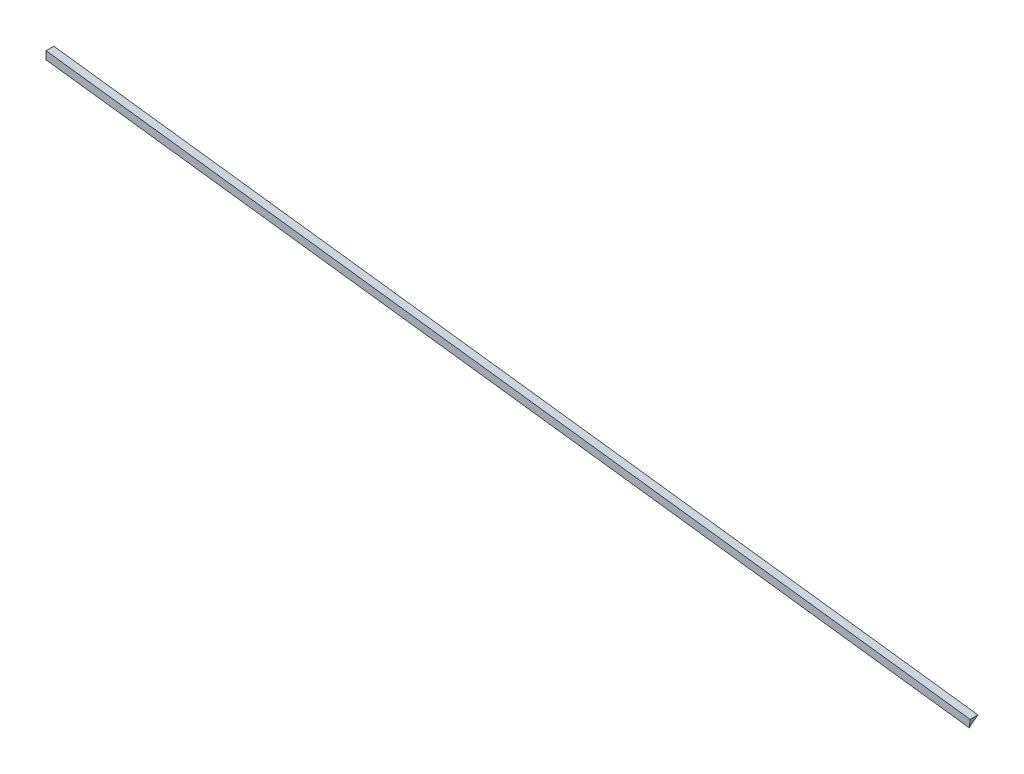
ISO-10303-21;
HEADER;
FILE_DESCRIPTION(('STEP AP214'),'2;1');
FILE_NAME('part.step','',(''),(''),'','','');
FILE_SCHEMA(('AUTOMOTIVE_DESIGN { 1 0 10303 214 1 1 1 1 }'));
ENDSEC;
DATA;
#1=APPLICATION_CONTEXT('core data for automotive mechanical design processes');
#2=APPLICATION_PROTOCOL_DEFINITION('international standard','automotive_design',2000,#1);
#3=PRODUCT_CONTEXT('',#1,'mechanical');
#4=PRODUCT('Part','Part','',(#3));
#5=PRODUCT_RELATED_PRODUCT_CATEGORY('part','',(#4));
#6=PRODUCT_DEFINITION_FORMATION('','',#4);
#7=PRODUCT_DEFINITION_CONTEXT('part definition',#1,'design');
#8=PRODUCT_DEFINITION('design','',#6,#7);
#9=PRODUCT_DEFINITION_SHAPE('','',#8);
#10=(LENGTH_UNIT() NAMED_UNIT(*) SI_UNIT(.MILLI.,.METRE.));
#11=(NAMED_UNIT(*) PLANE_ANGLE_UNIT() SI_UNIT($,.RADIAN.));
#12=(NAMED_UNIT(*) SI_UNIT($,.STERADIAN.) SOLID_ANGLE_UNIT());
#13=UNCERTAINTY_MEASURE_WITH_UNIT(LENGTH_MEASURE(1.E-05),#10,'distance_accuracy_value','');
#14=(GEOMETRIC_REPRESENTATION_CONTEXT(3) GLOBAL_UNCERTAINTY_ASSIGNED_CONTEXT((#13)) GLOBAL_UNIT_ASSIGNED_CONTEXT((#10,
#11,#12)) REPRESENTATION_CONTEXT('',''));
#15=CARTESIAN_POINT('',(0.,0.,0.));
#16=DIRECTION('',(0.,0.,1.));
#17=DIRECTION('',(1.,0.,0.));
#18=AXIS2_PLACEMENT_3D('',#15,#16,#17);
#19=CARTESIAN_POINT('',(-1545.06892366286,-103.964297032452,-250.));
#20=DIRECTION('',(0.,0.,-1.));
#21=DIRECTION('',(0.125664904436596,0.992072745212236,0.));
#22=AXIS2_PLACEMENT_3D('',#19,#20,#21);
#23=PLANE('',#22);
#24=DIRECTION('',(0.992072745212236,-0.125664904436596,0.));
#25=VECTOR('',#24,1.);
#26=CARTESIAN_POINT('',(-1542.55562557413,-84.1228421282074,-250.));
#27=LINE('',#26,#25);
#28=CARTESIAN_POINT('',(-352.068331319447,-234.920727452122,-250.));
#29=VERTEX_POINT('',#28);
#30=CARTESIAN_POINT('',(-1535.,-85.0799059829639,-250.));
#31=VERTEX_POINT('',#30);
#32=EDGE_CURVE('E60',#29,#31,#27,.F.);
#33=ORIENTED_EDGE('',*,*,#32,.F.);
#34=DIRECTION('',(-0.125664904436596,-0.992072745212236,0.));
#35=VECTOR('',#34,1.);
#36=CARTESIAN_POINT('',(-354.581629408179,-254.762182356367,-250.));
#37=LINE('',#36,#35);
#38=CARTESIAN_POINT('',(-350.811682275081,-225.,-250.));
#39=VERTEX_POINT('',#38);
#40=EDGE_CURVE('E129',#39,#29,#37,.T.);
#41=ORIENTED_EDGE('',*,*,#40,.F.);
#42=DIRECTION('',(0.992072745212236,-0.125664904436596,0.));
#43=VECTOR('',#42,1.);
#44=CARTESIAN_POINT('',(-1541.29897652976,-74.2021146760851,-250.));
#45=LINE('',#44,#43);
#46=CARTESIAN_POINT('',(-1535.,-75.0000000000002,-250.));
#47=VERTEX_POINT('',#46);
#48=EDGE_CURVE('E86',#47,#39,#45,.T.);
#49=ORIENTED_EDGE('',*,*,#48,.F.);
#50=DIRECTION('',(0.,1.,0.));
#51=VECTOR('',#50,1.);
#52=CARTESIAN_POINT('',(-1535.,-74.9999999999998,-250.));
#53=LINE('',#52,#51);
#54=EDGE_CURVE('E89',#31,#47,#53,.T.);
#55=ORIENTED_EDGE('',*,*,#54,.F.);
#56=EDGE_LOOP('',(#33,#41,#49,#55));
#57=FACE_BOUND('',#56,.T.);
#58=ADVANCED_FACE('F57',(#57),#23,.F.);
#59=CARTESIAN_POINT('',(-360.314750092433,-300.022812612353,-325.622289771002));
#60=DIRECTION('',(-0.992072745212234,0.125664904436611,0.));
#61=DIRECTION('',(-0.125664904436611,-0.992072745212234,0.));
#62=AXIS2_PLACEMENT_3D('',#59,#60,#61);
#63=PLANE('',#62);
#64=DIRECTION('',(0.,0.,1.));
#65=VECTOR('',#64,1.);
#66=CARTESIAN_POINT('',(-350.811682275081,-225.,-250.));
#67=LINE('',#66,#65);
#68=CARTESIAN_POINT('',(-350.811682275081,-225.,-260.));
#69=VERTEX_POINT('',#68);
#70=EDGE_CURVE('E128',#69,#39,#67,.T.);
#71=ORIENTED_EDGE('',*,*,#70,.T.);
#72=ORIENTED_EDGE('',*,*,#40,.T.);
#73=CARTESIAN_POINT('',(-350.811682275081,-225.,-260.));
#74=CARTESIAN_POINT('',(-350.909315335214,-225.770772861555,-259.104660064685));
#75=CARTESIAN_POINT('',(-351.008948266641,-226.557333884597,-258.223129382851));
#76=CARTESIAN_POINT('',(-351.212084335588,-228.161009616306,-256.488772722489));
#77=CARTESIAN_POINT('',(-351.315587473109,-228.978124324973,-255.63594674396));
#78=CARTESIAN_POINT('',(-351.525270058002,-230.633482108048,-253.968549482113));
#79=CARTESIAN_POINT('',(-351.631411912324,-231.471428400775,-253.153678805655));
#80=CARTESIAN_POINT('',(-351.847245554005,-233.175346247783,-251.554003141038));
#81=CARTESIAN_POINT('',(-351.956937884984,-234.04132209371,-250.769202797547));
#82=CARTESIAN_POINT('',(-352.068331319447,-234.920727452123,-250.));
#83=B_SPLINE_CURVE_WITH_KNOTS('',3,(#73,#74,#75,#76,#77,#78,#79,#80,#81,#82),.UNSPECIFIED.,.F.,
.F.,(4,2,2,2,4),(0.,3.55611978975982,7.11223957951967,10.6324396004395,14.1531811779702),.UNSPECIFIED.);
#84=EDGE_CURVE('E100',#69,#29,#83,.T.);
#85=ORIENTED_EDGE('',*,*,#84,.F.);
#86=EDGE_LOOP('',(#71,#72,#85));
#87=FACE_BOUND('',#86,.T.);
#88=ADVANCED_FACE('F106',(#87),#63,.F.);
#89=CARTESIAN_POINT('',(-350.811682275086,-225.,-250.));
#90=DIRECTION('',(0.125664904436596,0.992072745212236,0.));
#91=DIRECTION('',(-0.992072745212236,0.125664904436596,0.));
#92=AXIS2_PLACEMENT_3D('',#89,#90,#91);
#93=PLANE('',#92);
#94=DIRECTION('',(-0.992072745212236,0.125664904436596,0.));
#95=VECTOR('',#94,1.);
#96=CARTESIAN_POINT('',(-350.811682275086,-225.,-260.));
#97=LINE('',#96,#95);
#98=CARTESIAN_POINT('',(-1535.,-75.0000000000002,-260.));
#99=VERTEX_POINT('',#98);
#100=EDGE_CURVE('E66',#99,#69,#97,.F.);
#101=ORIENTED_EDGE('',*,*,#100,.F.);
#102=DIRECTION('',(0.,0.,1.));
#103=VECTOR('',#102,1.);
#104=CARTESIAN_POINT('',(-1535.,-75.0000000000002,-250.));
#105=LINE('',#104,#103);
#106=EDGE_CURVE('E93',#99,#47,#105,.T.);
#107=ORIENTED_EDGE('',*,*,#106,.T.);
#108=ORIENTED_EDGE('',*,*,#48,.T.);
#109=ORIENTED_EDGE('',*,*,#70,.F.);
#110=EDGE_LOOP('',(#101,#107,#108,#109));
#111=FACE_BOUND('',#110,.T.);
#112=ADVANCED_FACE('F142',(#111),#93,.T.);
#113=CARTESIAN_POINT('',(-1535.,-150.945667612787,-326.47229370376));
#114=DIRECTION('',(-1.,0.,0.));
#115=DIRECTION('',(0.,0.,1.));
#116=AXIS2_PLACEMENT_3D('',#113,#114,#115);
#117=PLANE('',#116);
#118=ORIENTED_EDGE('',*,*,#106,.F.);
#119=CARTESIAN_POINT('',(-1535.,-85.0799059829639,-250.));
#120=CARTESIAN_POINT('',(-1535.,-84.1817020546006,-250.773613669873));
#121=CARTESIAN_POINT('',(-1535.,-83.2971393450945,-251.563064841683));
#122=CARTESIAN_POINT('',(-1535.,-81.5563684858123,-253.172633154599));
#123=CARTESIAN_POINT('',(-1535.,-80.700160336036,-253.992750295706));
#124=CARTESIAN_POINT('',(-1535.,-79.0189741302379,-255.660852136253));
#125=CARTESIAN_POINT('',(-1535.,-78.1939330773144,-256.508773345864));
#126=CARTESIAN_POINT('',(-1535.,-76.5740363562539,-258.233222639635));
#127=CARTESIAN_POINT('',(-1535.,-75.7791853892476,-259.109755139885));
#128=CARTESIAN_POINT('',(-1535.,-75.0000000000003,-260.));
#129=B_SPLINE_CURVE_WITH_KNOTS('',3,(#119,#120,#121,#122,#123,#124,#125,#126,#127,#128),
.UNSPECIFIED.,.F.,.F.,(4,2,2,2,4),(0.,3.55611090537572,7.11222181075146,10.6607115958962,
14.209751697054),.UNSPECIFIED.);
#130=EDGE_CURVE('E12',#31,#99,#129,.T.);
#131=ORIENTED_EDGE('',*,*,#130,.F.);
#132=ORIENTED_EDGE('',*,*,#54,.T.);
#133=EDGE_LOOP('',(#118,#131,#132));
#134=FACE_BOUND('',#133,.T.);
#135=ADVANCED_FACE('F95',(#134),#117,.T.);
#136=CARTESIAN_POINT('',(-1535.,-85.0799059829639,-250.));
#137=CARTESIAN_POINT('',(-1485.76348528417,-91.3166481436729,-250.));
#138=CARTESIAN_POINT('',(-1387.29045585252,-103.790132465091,-250.));
#139=CARTESIAN_POINT('',(-1255.8536037769,-120.439112628331,-250.));
#140=CARTESIAN_POINT('',(-1157.38057434525,-132.912596949749,-250.));
#141=CARTESIAN_POINT('',(-1058.90754491359,-145.386081271167,-250.));
#142=CARTESIAN_POINT('',(-944.161823410078,-159.920811911471,-250.));
#143=CARTESIAN_POINT('',(-828.997663406324,-174.508545755824,-250.));
#144=CARTESIAN_POINT('',(-730.52463397467,-186.982030077242,-250.));
#145=CARTESIAN_POINT('',(-632.051604543016,-199.45551439866,-250.));
#146=CARTESIAN_POINT('',(-500.614752467399,-216.1044945619,-250.));
#147=CARTESIAN_POINT('',(-401.723284535509,-228.630982087366,-250.));
#148=CARTESIAN_POINT('',(-352.068331319447,-234.920727452123,-250.));
#149=CARTESIAN_POINT('',(-1535.,-81.4878566331357,-253.093840328039));
#150=CARTESIAN_POINT('',(-1485.73432980355,-87.7271072749897,-253.094226438394));
#151=CARTESIAN_POINT('',(-1387.2001091207,-100.205973333306,-253.094998681582));
#152=CARTESIAN_POINT('',(-1255.72670096562,-116.860431399332,-253.094722489142));
#153=CARTESIAN_POINT('',(-1157.21837701204,-129.338349355657,-253.094734577626));
#154=CARTESIAN_POINT('',(-1058.70912016459,-141.816324661947,-253.094766489225));
#155=CARTESIAN_POINT('',(-943.923542502911,-156.356156956111,-253.09474917789));
#156=CARTESIAN_POINT('',(-828.718383926324,-170.94906976847,-253.094753832909));
#157=CARTESIAN_POINT('',(-730.210453229073,-183.426973151458,-253.094754435343));
#158=CARTESIAN_POINT('',(-631.702598415421,-195.90487133893,-253.094753598247));
#159=CARTESIAN_POINT('',(-500.219183090493,-212.559748477789,-253.094753971958));
#160=CARTESIAN_POINT('',(-401.292700242263,-225.090671482581,-253.094753915437));
#161=CARTESIAN_POINT('',(-351.620165670711,-231.38264394787,-253.094753887057));
#162=CARTESIAN_POINT('',(-1535.,-78.1223302952721,-256.432687281128));
#163=CARTESIAN_POINT('',(-1485.71660202536,-84.3638076456944,-256.433092094153));
#164=CARTESIAN_POINT('',(-1387.14691546282,-96.8471284276922,-256.43390174377));
#165=CARTESIAN_POINT('',(-1255.62717948981,-113.507468279337,-256.433612172937));
#166=CARTESIAN_POINT('',(-1157.08397629921,-125.989803764979,-256.433624846972));
#167=CARTESIAN_POINT('',(-1058.53982484644,-138.472197579398,-256.433658304325));
#168=CARTESIAN_POINT('',(-943.713628472961,-153.017175852118,-256.433640154453));
#169=CARTESIAN_POINT('',(-828.467685986935,-167.615254495939,-256.433645034954));
#170=CARTESIAN_POINT('',(-729.92488494775,-180.097574842327,-256.43364566657));
#171=CARTESIAN_POINT('',(-631.382160907864,-192.579889922161,-256.433644788926));
#172=CARTESIAN_POINT('',(-499.852202736097,-209.240662580604,-256.43364518074));
#173=CARTESIAN_POINT('',(-400.890701885136,-221.776021285021,-256.433645121481));
#174=CARTESIAN_POINT('',(-351.200584226553,-228.070220984489,-256.433645091726));
#175=CARTESIAN_POINT('',(-1535.,-75.0000000000003,-260.));
#176=CARTESIAN_POINT('',(-1485.71118047164,-81.2433675612152,-260.));
#177=CARTESIAN_POINT('',(-1387.13354141493,-93.7301026836451,-260.));
#178=CARTESIAN_POINT('',(-1255.55706166772,-110.396769350312,-260.));
#179=CARTESIAN_POINT('',(-1156.979422611,-122.883504472742,-260.));
#180=CARTESIAN_POINT('',(-1058.40178355429,-135.370239595172,-260.));
#181=CARTESIAN_POINT('',(-943.534165659723,-149.92041073458,-260.));
#182=CARTESIAN_POINT('',(-828.247664750366,-164.523641384268,-260.));
#183=CARTESIAN_POINT('',(-729.670025693653,-177.010376506698,-260.));
#184=CARTESIAN_POINT('',(-631.09238663694,-189.497111629128,-260.));
#185=CARTESIAN_POINT('',(-499.515906889727,-206.163778295795,-260.));
#186=CARTESIAN_POINT('',(-400.519384818226,-218.703572928505,-260.));
#187=CARTESIAN_POINT('',(-350.811682275081,-225.,-260.));
#188=(BOUNDED_SURFACE() B_SPLINE_SURFACE(3,3,((#136,#137,#138,#139,#140,#141,#142,#143,#144,
#145,#146,#147,#148),(#149,#150,#151,#152,#153,#154,#155,#156,#157,#158,#159,#160,#161),(#162,
#163,#164,#165,#166,#167,#168,#169,#170,#171,#172,#173,#174),(#175,#176,#177,#178,#179,#180,
#181,#182,#183,#184,#185,#186,#187)),.UNSPECIFIED.,.F.,.F.,.F.) B_SPLINE_SURFACE_WITH_KNOTS((4,
4),(4,1,1,1,1,1,1,1,1,1,4),(0.,1.),(0.,0.124867351224299,0.249734702448598,0.333333333333333,
0.374602053672897,0.499469404897196,0.624336756121495,0.666666666666667,0.749204107345793,
0.874071458570093,1.),
.UNSPECIFIED.) GEOMETRIC_REPRESENTATION_ITEM() RATIONAL_B_SPLINE_SURFACE(((1.,1.,1.,1.,1.,1.,1.,
1.,1.,1.,1.,1.,1.),(0.99834864555561,0.99834864555561,0.998329273309877,0.998336201699237,
0.998335898452029,0.99833509793426,0.998335532203869,0.998335415407226,0.99833540033779,
0.998335421351381,0.998335411608463,0.998335414065751,0.998335414065751),(0.99834864555561,
0.99834864555561,0.998329273309877,0.998336201699237,0.998335898452029,0.99833509793426,
0.998335532203869,0.998335415407226,0.99833540033779,0.998335421351381,0.998335411608463,
0.998335414065751,0.998335414065751),(1.,1.,1.,1.,1.,1.,1.,1.,1.,1.,1.,1.,1.))) REPRESENTATION_ITEM('') SURFACE());
#189=ORIENTED_EDGE('',*,*,#130,.T.);
#190=ORIENTED_EDGE('',*,*,#100,.T.);
#191=ORIENTED_EDGE('',*,*,#84,.T.);
#192=ORIENTED_EDGE('',*,*,#32,.T.);
#193=EDGE_LOOP('',(#189,#190,#191,#192));
#194=FACE_BOUND('',#193,.T.);
#195=ADVANCED_FACE('F99',(#194),#188,.T.);
#196=CLOSED_SHELL('',(#58,#88,#112,#135,#195));
#197=MANIFOLD_SOLID_BREP('B2',#196);
#198=ADVANCED_BREP_SHAPE_REPRESENTATION('',(#18,#197),#14);
#199=SHAPE_DEFINITION_REPRESENTATION(#9,#198);
ENDSEC;
END-ISO-10303-21;
